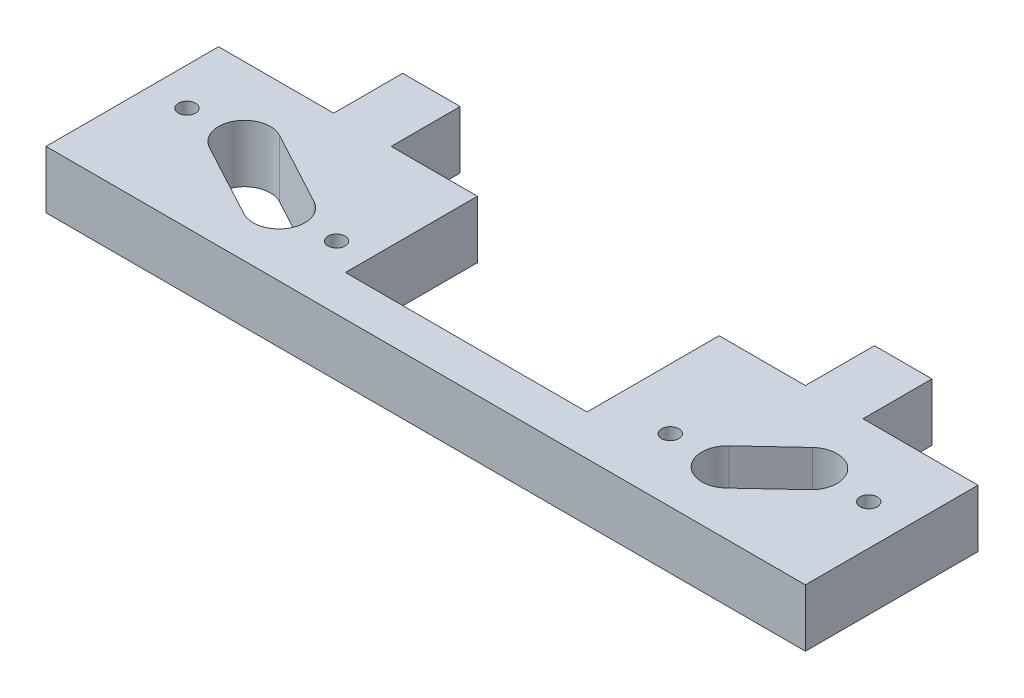
ISO-10303-21;
HEADER;
FILE_DESCRIPTION(('STEP AP214'),'2;1');
FILE_NAME('part.step','',(''),(''),'','','');
FILE_SCHEMA(('AUTOMOTIVE_DESIGN { 1 0 10303 214 1 1 1 1 }'));
ENDSEC;
DATA;
#1=APPLICATION_CONTEXT('core data for automotive mechanical design processes');
#2=APPLICATION_PROTOCOL_DEFINITION('international standard','automotive_design',2000,#1);
#3=PRODUCT_CONTEXT('',#1,'mechanical');
#4=PRODUCT('Part','Part','',(#3));
#5=PRODUCT_RELATED_PRODUCT_CATEGORY('part','',(#4));
#6=PRODUCT_DEFINITION_FORMATION('','',#4);
#7=PRODUCT_DEFINITION_CONTEXT('part definition',#1,'design');
#8=PRODUCT_DEFINITION('design','',#6,#7);
#9=PRODUCT_DEFINITION_SHAPE('','',#8);
#10=(LENGTH_UNIT() NAMED_UNIT(*) SI_UNIT(.MILLI.,.METRE.));
#11=(NAMED_UNIT(*) PLANE_ANGLE_UNIT() SI_UNIT($,.RADIAN.));
#12=(NAMED_UNIT(*) SI_UNIT($,.STERADIAN.) SOLID_ANGLE_UNIT());
#13=UNCERTAINTY_MEASURE_WITH_UNIT(LENGTH_MEASURE(1.E-05),#10,'distance_accuracy_value','');
#14=(GEOMETRIC_REPRESENTATION_CONTEXT(3) GLOBAL_UNCERTAINTY_ASSIGNED_CONTEXT((#13)) GLOBAL_UNIT_ASSIGNED_CONTEXT((#10,
#11,#12)) REPRESENTATION_CONTEXT('',''));
#15=CARTESIAN_POINT('',(0.,0.,0.));
#16=DIRECTION('',(0.,0.,1.));
#17=DIRECTION('',(1.,0.,0.));
#18=AXIS2_PLACEMENT_3D('',#15,#16,#17);
#19=CARTESIAN_POINT('',(0.,20.,0.));
#20=DIRECTION('',(0.,1.,0.));
#21=DIRECTION('',(0.,0.,1.));
#22=AXIS2_PLACEMENT_3D('',#19,#20,#21);
#23=PLANE('',#22);
#24=CARTESIAN_POINT('',(195.,20.,-22.));
#25=DIRECTION('',(0.,1.,0.));
#26=DIRECTION('',(0.,0.,1.));
#27=AXIS2_PLACEMENT_3D('',#24,#25,#26);
#28=CIRCLE('',#27,2.99999999999999);
#29=CARTESIAN_POINT('',(195.,20.,-19.));
#30=VERTEX_POINT('',#29);
#31=EDGE_CURVE('E300',#30,#30,#28,.T.);
#32=ORIENTED_EDGE('',*,*,#31,.F.);
#33=EDGE_LOOP('',(#32));
#34=FACE_BOUND('',#33,.T.);
#35=CARTESIAN_POINT('',(13.,20.,-36.));
#36=DIRECTION('',(0.,1.,0.));
#37=DIRECTION('',(0.,0.,1.));
#38=AXIS2_PLACEMENT_3D('',#35,#36,#37);
#39=CIRCLE('',#38,3.);
#40=CARTESIAN_POINT('',(13.,20.,-33.));
#41=VERTEX_POINT('',#40);
#42=EDGE_CURVE('E316',#41,#41,#39,.T.);
#43=ORIENTED_EDGE('',*,*,#42,.F.);
#44=EDGE_LOOP('',(#43));
#45=FACE_BOUND('',#44,.T.);
#46=DIRECTION('',(-1.,0.,0.));
#47=VECTOR('',#46,1.);
#48=CARTESIAN_POINT('',(60.,20.,-84.));
#49=LINE('',#48,#47);
#50=CARTESIAN_POINT('',(60.,20.,-84.));
#51=VERTEX_POINT('',#50);
#52=CARTESIAN_POINT('',(40.,20.,-84.));
#53=VERTEX_POINT('',#52);
#54=EDGE_CURVE('E324',#51,#53,#49,.T.);
#55=ORIENTED_EDGE('',*,*,#54,.T.);
#56=DIRECTION('',(0.,0.,1.));
#57=VECTOR('',#56,1.);
#58=CARTESIAN_POINT('',(40.,20.,-84.));
#59=LINE('',#58,#57);
#60=CARTESIAN_POINT('',(40.,20.,-60.));
#61=VERTEX_POINT('',#60);
#62=EDGE_CURVE('E328',#53,#61,#59,.T.);
#63=ORIENTED_EDGE('',*,*,#62,.T.);
#64=DIRECTION('',(-1.,0.,0.));
#65=VECTOR('',#64,1.);
#66=CARTESIAN_POINT('',(40.,20.,-60.));
#67=LINE('',#66,#65);
#68=CARTESIAN_POINT('',(0.,20.,-60.));
#69=VERTEX_POINT('',#68);
#70=EDGE_CURVE('E332',#61,#69,#67,.T.);
#71=ORIENTED_EDGE('',*,*,#70,.T.);
#72=DIRECTION('',(0.,0.,1.));
#73=VECTOR('',#72,1.);
#74=CARTESIAN_POINT('',(0.,20.,-60.));
#75=LINE('',#74,#73);
#76=CARTESIAN_POINT('',(0.,20.,0.));
#77=VERTEX_POINT('',#76);
#78=EDGE_CURVE('E335',#69,#77,#75,.T.);
#79=ORIENTED_EDGE('',*,*,#78,.T.);
#80=DIRECTION('',(1.,0.,0.));
#81=VECTOR('',#80,1.);
#82=CARTESIAN_POINT('',(0.,20.,0.));
#83=LINE('',#82,#81);
#84=CARTESIAN_POINT('',(264.,20.,0.));
#85=VERTEX_POINT('',#84);
#86=EDGE_CURVE('E338',#77,#85,#83,.T.);
#87=ORIENTED_EDGE('',*,*,#86,.T.);
#88=DIRECTION('',(0.,0.,-1.));
#89=VECTOR('',#88,1.);
#90=CARTESIAN_POINT('',(264.,20.,0.));
#91=LINE('',#90,#89);
#92=CARTESIAN_POINT('',(264.,20.,-60.));
#93=VERTEX_POINT('',#92);
#94=EDGE_CURVE('E341',#85,#93,#91,.T.);
#95=ORIENTED_EDGE('',*,*,#94,.T.);
#96=DIRECTION('',(-1.,0.,0.));
#97=VECTOR('',#96,1.);
#98=CARTESIAN_POINT('',(264.,20.,-60.));
#99=LINE('',#98,#97);
#100=CARTESIAN_POINT('',(224.,20.,-60.));
#101=VERTEX_POINT('',#100);
#102=EDGE_CURVE('E344',#93,#101,#99,.T.);
#103=ORIENTED_EDGE('',*,*,#102,.T.);
#104=DIRECTION('',(0.,0.,-1.));
#105=VECTOR('',#104,1.);
#106=CARTESIAN_POINT('',(224.,20.,-60.));
#107=LINE('',#106,#105);
#108=CARTESIAN_POINT('',(224.,20.,-84.));
#109=VERTEX_POINT('',#108);
#110=EDGE_CURVE('E347',#101,#109,#107,.T.);
#111=ORIENTED_EDGE('',*,*,#110,.T.);
#112=DIRECTION('',(-1.,0.,0.));
#113=VECTOR('',#112,1.);
#114=CARTESIAN_POINT('',(224.,20.,-84.));
#115=LINE('',#114,#113);
#116=CARTESIAN_POINT('',(204.,20.,-84.));
#117=VERTEX_POINT('',#116);
#118=EDGE_CURVE('E350',#109,#117,#115,.T.);
#119=ORIENTED_EDGE('',*,*,#118,.T.);
#120=DIRECTION('',(0.,0.,1.));
#121=VECTOR('',#120,1.);
#122=CARTESIAN_POINT('',(204.,20.,-60.));
#123=LINE('',#122,#121);
#124=CARTESIAN_POINT('',(204.,20.,-60.));
#125=VERTEX_POINT('',#124);
#126=EDGE_CURVE('E353',#117,#125,#123,.T.);
#127=ORIENTED_EDGE('',*,*,#126,.T.);
#128=DIRECTION('',(-1.,0.,0.));
#129=VECTOR('',#128,1.);
#130=CARTESIAN_POINT('',(174.,20.,-60.));
#131=LINE('',#130,#129);
#132=CARTESIAN_POINT('',(174.,20.,-60.));
#133=VERTEX_POINT('',#132);
#134=EDGE_CURVE('E356',#125,#133,#131,.T.);
#135=ORIENTED_EDGE('',*,*,#134,.T.);
#136=DIRECTION('',(0.,0.,1.));
#137=VECTOR('',#136,1.);
#138=CARTESIAN_POINT('',(174.,20.,-14.0757601007004));
#139=LINE('',#138,#137);
#140=CARTESIAN_POINT('',(174.,20.,-14.0757601007004));
#141=VERTEX_POINT('',#140);
#142=EDGE_CURVE('E359',#133,#141,#139,.T.);
#143=ORIENTED_EDGE('',*,*,#142,.T.);
#144=DIRECTION('',(-1.,0.,0.));
#145=VECTOR('',#144,1.);
#146=CARTESIAN_POINT('',(90.,20.,-14.0757601007004));
#147=LINE('',#146,#145);
#148=CARTESIAN_POINT('',(90.,20.,-14.0757601007004));
#149=VERTEX_POINT('',#148);
#150=EDGE_CURVE('E362',#141,#149,#147,.T.);
#151=ORIENTED_EDGE('',*,*,#150,.T.);
#152=DIRECTION('',(0.,0.,-1.));
#153=VECTOR('',#152,1.);
#154=CARTESIAN_POINT('',(90.,20.,-60.));
#155=LINE('',#154,#153);
#156=CARTESIAN_POINT('',(90.,20.,-60.));
#157=VERTEX_POINT('',#156);
#158=EDGE_CURVE('E365',#149,#157,#155,.T.);
#159=ORIENTED_EDGE('',*,*,#158,.T.);
#160=DIRECTION('',(-1.,0.,0.));
#161=VECTOR('',#160,1.);
#162=CARTESIAN_POINT('',(60.,20.,-60.));
#163=LINE('',#162,#161);
#164=CARTESIAN_POINT('',(60.,20.,-60.));
#165=VERTEX_POINT('',#164);
#166=EDGE_CURVE('E368',#157,#165,#163,.T.);
#167=ORIENTED_EDGE('',*,*,#166,.T.);
#168=DIRECTION('',(0.,0.,-1.));
#169=VECTOR('',#168,1.);
#170=CARTESIAN_POINT('',(60.,20.,-84.));
#171=LINE('',#170,#169);
#172=EDGE_CURVE('E371',#165,#51,#171,.T.);
#173=ORIENTED_EDGE('',*,*,#172,.T.);
#174=EDGE_LOOP('',(#55,#63,#71,#79,#87,#95,#103,#111,#119,#127,#135,#143,#151,#159,#167,#173));
#175=FACE_BOUND('',#174,.T.);
#176=CARTESIAN_POINT('',(79.,20.,-22.));
#177=DIRECTION('',(0.,1.,0.));
#178=DIRECTION('',(0.,0.,1.));
#179=AXIS2_PLACEMENT_3D('',#176,#177,#178);
#180=CIRCLE('',#179,3.00000000000001);
#181=CARTESIAN_POINT('',(79.,20.,-19.));
#182=VERTEX_POINT('',#181);
#183=EDGE_CURVE('E308',#182,#182,#180,.T.);
#184=ORIENTED_EDGE('',*,*,#183,.F.);
#185=EDGE_LOOP('',(#184));
#186=FACE_BOUND('',#185,.T.);
#187=CARTESIAN_POINT('',(250.,20.,-36.));
#188=DIRECTION('',(0.,1.,0.));
#189=DIRECTION('',(0.,0.,1.));
#190=AXIS2_PLACEMENT_3D('',#187,#188,#189);
#191=CIRCLE('',#190,2.99999999999999);
#192=CARTESIAN_POINT('',(250.,20.,-33.));
#193=VERTEX_POINT('',#192);
#194=EDGE_CURVE('E292',#193,#193,#191,.T.);
#195=ORIENTED_EDGE('',*,*,#194,.F.);
#196=EDGE_LOOP('',(#195));
#197=FACE_BOUND('',#196,.T.);
#198=DIRECTION('',(-0.880471099922175,0.,-0.474099823035018));
#199=VECTOR('',#198,1.);
#200=CARTESIAN_POINT('',(37.2668984073152,20.,-43.9242398992996));
#201=LINE('',#200,#199);
#202=CARTESIAN_POINT('',(63.2668984073151,20.,-29.9242398992996));
#203=VERTEX_POINT('',#202);
#204=CARTESIAN_POINT('',(37.2668984073152,20.,-43.9242398992996));
#205=VERTEX_POINT('',#204);
#206=EDGE_CURVE('E252',#203,#205,#201,.T.);
#207=ORIENTED_EDGE('',*,*,#206,.F.);
#208=CARTESIAN_POINT('',(59.,20.,-22.));
#209=DIRECTION('',(0.,1.,0.));
#210=DIRECTION('',(0.,0.,1.));
#211=AXIS2_PLACEMENT_3D('',#208,#209,#210);
#212=CIRCLE('',#211,9.);
#213=CARTESIAN_POINT('',(54.7331015926848,20.,-14.0757601007004));
#214=VERTEX_POINT('',#213);
#215=EDGE_CURVE('E249',#214,#203,#212,.T.);
#216=ORIENTED_EDGE('',*,*,#215,.F.);
#217=DIRECTION('',(0.880471099922175,0.,0.474099823035017));
#218=VECTOR('',#217,1.);
#219=CARTESIAN_POINT('',(28.7331015926848,20.,-28.0757601007004));
#220=LINE('',#219,#218);
#221=CARTESIAN_POINT('',(28.7331015926848,20.,-28.0757601007004));
#222=VERTEX_POINT('',#221);
#223=EDGE_CURVE('E260',#222,#214,#220,.T.);
#224=ORIENTED_EDGE('',*,*,#223,.F.);
#225=CARTESIAN_POINT('',(33.,20.,-36.));
#226=DIRECTION('',(0.,1.,0.));
#227=DIRECTION('',(0.,0.,1.));
#228=AXIS2_PLACEMENT_3D('',#225,#226,#227);
#229=CIRCLE('',#228,9.00000000000001);
#230=EDGE_CURVE('E256',#205,#222,#229,.T.);
#231=ORIENTED_EDGE('',*,*,#230,.F.);
#232=EDGE_LOOP('',(#207,#216,#224,#231));
#233=FACE_BOUND('',#232,.T.);
#234=DIRECTION('',(-0.73105526824287,0.,0.68231825036001));
#235=VECTOR('',#234,1.);
#236=CARTESIAN_POINT('',(208.85913574676,20.,-28.5794974141858));
#237=LINE('',#236,#235);
#238=CARTESIAN_POINT('',(223.85913574676,20.,-42.5794974141858));
#239=VERTEX_POINT('',#238);
#240=CARTESIAN_POINT('',(208.85913574676,20.,-28.5794974141859));
#241=VERTEX_POINT('',#240);
#242=EDGE_CURVE('E210',#239,#241,#237,.T.);
#243=ORIENTED_EDGE('',*,*,#242,.F.);
#244=CARTESIAN_POINT('',(230.,20.,-36.));
#245=DIRECTION('',(0.,1.,0.));
#246=DIRECTION('',(0.,0.,1.));
#247=AXIS2_PLACEMENT_3D('',#244,#245,#246);
#248=CIRCLE('',#247,9.00000000000001);
#249=CARTESIAN_POINT('',(236.14086425324,20.,-29.4205025858142));
#250=VERTEX_POINT('',#249);
#251=EDGE_CURVE('E201',#250,#239,#248,.T.);
#252=ORIENTED_EDGE('',*,*,#251,.F.);
#253=DIRECTION('',(0.731055268242868,0.,-0.682318250360013));
#254=VECTOR('',#253,1.);
#255=CARTESIAN_POINT('',(236.14086425324,20.,-29.4205025858142));
#256=LINE('',#255,#254);
#257=CARTESIAN_POINT('',(221.14086425324,20.,-15.4205025858142));
#258=VERTEX_POINT('',#257);
#259=EDGE_CURVE('E227',#258,#250,#256,.T.);
#260=ORIENTED_EDGE('',*,*,#259,.F.);
#261=CARTESIAN_POINT('',(215.,20.,-22.));
#262=DIRECTION('',(0.,1.,0.));
#263=DIRECTION('',(0.,0.,1.));
#264=AXIS2_PLACEMENT_3D('',#261,#262,#263);
#265=CIRCLE('',#264,9.00000000000005);
#266=EDGE_CURVE('E223',#241,#258,#265,.T.);
#267=ORIENTED_EDGE('',*,*,#266,.F.);
#268=EDGE_LOOP('',(#243,#252,#260,#267));
#269=FACE_BOUND('',#268,.T.);
#270=ADVANCED_FACE('F39',(#34,#45,#175,#186,#197,#233,#269),#23,.T.);
#271=CARTESIAN_POINT('',(0.,0.,0.));
#272=DIRECTION('',(0.,1.,0.));
#273=DIRECTION('',(0.,0.,1.));
#274=AXIS2_PLACEMENT_3D('',#271,#272,#273);
#275=PLANE('',#274);
#276=CARTESIAN_POINT('',(59.,0.,-22.));
#277=DIRECTION('',(0.,1.,0.));
#278=DIRECTION('',(0.,0.,1.));
#279=AXIS2_PLACEMENT_3D('',#276,#277,#278);
#280=CIRCLE('',#279,9.);
#281=CARTESIAN_POINT('',(54.7331015926848,0.,-14.0757601007004));
#282=VERTEX_POINT('',#281);
#283=CARTESIAN_POINT('',(63.2668984073151,0.,-29.9242398992996));
#284=VERTEX_POINT('',#283);
#285=EDGE_CURVE('E219',#282,#284,#280,.T.);
#286=ORIENTED_EDGE('',*,*,#285,.T.);
#287=DIRECTION('',(-0.880471099922175,0.,-0.474099823035018));
#288=VECTOR('',#287,1.);
#289=CARTESIAN_POINT('',(37.2668984073152,0.,-43.9242398992996));
#290=LINE('',#289,#288);
#291=CARTESIAN_POINT('',(37.2668984073152,0.,-43.9242398992996));
#292=VERTEX_POINT('',#291);
#293=EDGE_CURVE('E267',#284,#292,#290,.T.);
#294=ORIENTED_EDGE('',*,*,#293,.T.);
#295=CARTESIAN_POINT('',(33.,0.,-36.));
#296=DIRECTION('',(0.,1.,0.));
#297=DIRECTION('',(0.,0.,1.));
#298=AXIS2_PLACEMENT_3D('',#295,#296,#297);
#299=CIRCLE('',#298,9.00000000000001);
#300=CARTESIAN_POINT('',(28.7331015926848,0.,-28.0757601007004));
#301=VERTEX_POINT('',#300);
#302=EDGE_CURVE('E271',#292,#301,#299,.T.);
#303=ORIENTED_EDGE('',*,*,#302,.T.);
#304=DIRECTION('',(0.880471099922175,0.,0.474099823035017));
#305=VECTOR('',#304,1.);
#306=CARTESIAN_POINT('',(28.7331015926848,0.,-28.0757601007004));
#307=LINE('',#306,#305);
#308=EDGE_CURVE('E253',#301,#282,#307,.T.);
#309=ORIENTED_EDGE('',*,*,#308,.T.);
#310=EDGE_LOOP('',(#286,#294,#303,#309));
#311=FACE_BOUND('',#310,.T.);
#312=DIRECTION('',(-1.,0.,0.));
#313=VECTOR('',#312,1.);
#314=CARTESIAN_POINT('',(60.,0.,-84.));
#315=LINE('',#314,#313);
#316=CARTESIAN_POINT('',(60.,0.,-84.));
#317=VERTEX_POINT('',#316);
#318=CARTESIAN_POINT('',(40.,0.,-84.));
#319=VERTEX_POINT('',#318);
#320=EDGE_CURVE('E320',#317,#319,#315,.T.);
#321=ORIENTED_EDGE('',*,*,#320,.F.);
#322=DIRECTION('',(0.,0.,-1.));
#323=VECTOR('',#322,1.);
#324=CARTESIAN_POINT('',(60.,0.,-84.));
#325=LINE('',#324,#323);
#326=CARTESIAN_POINT('',(60.,0.,-60.));
#327=VERTEX_POINT('',#326);
#328=EDGE_CURVE('E329',#327,#317,#325,.T.);
#329=ORIENTED_EDGE('',*,*,#328,.F.);
#330=DIRECTION('',(-1.,0.,0.));
#331=VECTOR('',#330,1.);
#332=CARTESIAN_POINT('',(60.,0.,-60.));
#333=LINE('',#332,#331);
#334=CARTESIAN_POINT('',(90.,0.,-60.));
#335=VERTEX_POINT('',#334);
#336=EDGE_CURVE('E417',#335,#327,#333,.T.);
#337=ORIENTED_EDGE('',*,*,#336,.F.);
#338=DIRECTION('',(0.,0.,-1.));
#339=VECTOR('',#338,1.);
#340=CARTESIAN_POINT('',(90.,0.,-60.));
#341=LINE('',#340,#339);
#342=CARTESIAN_POINT('',(90.,0.,-14.0757601007004));
#343=VERTEX_POINT('',#342);
#344=EDGE_CURVE('E414',#343,#335,#341,.T.);
#345=ORIENTED_EDGE('',*,*,#344,.F.);
#346=DIRECTION('',(-1.,0.,0.));
#347=VECTOR('',#346,1.);
#348=CARTESIAN_POINT('',(90.,0.,-14.0757601007004));
#349=LINE('',#348,#347);
#350=CARTESIAN_POINT('',(174.,0.,-14.0757601007004));
#351=VERTEX_POINT('',#350);
#352=EDGE_CURVE('E411',#351,#343,#349,.T.);
#353=ORIENTED_EDGE('',*,*,#352,.F.);
#354=DIRECTION('',(0.,0.,1.));
#355=VECTOR('',#354,1.);
#356=CARTESIAN_POINT('',(174.,0.,-14.0757601007004));
#357=LINE('',#356,#355);
#358=CARTESIAN_POINT('',(174.,0.,-60.));
#359=VERTEX_POINT('',#358);
#360=EDGE_CURVE('E408',#359,#351,#357,.T.);
#361=ORIENTED_EDGE('',*,*,#360,.F.);
#362=DIRECTION('',(-1.,0.,0.));
#363=VECTOR('',#362,1.);
#364=CARTESIAN_POINT('',(174.,0.,-60.));
#365=LINE('',#364,#363);
#366=CARTESIAN_POINT('',(204.,0.,-60.));
#367=VERTEX_POINT('',#366);
#368=EDGE_CURVE('E405',#367,#359,#365,.T.);
#369=ORIENTED_EDGE('',*,*,#368,.F.);
#370=DIRECTION('',(0.,0.,1.));
#371=VECTOR('',#370,1.);
#372=CARTESIAN_POINT('',(204.,0.,-60.));
#373=LINE('',#372,#371);
#374=CARTESIAN_POINT('',(204.,0.,-84.));
#375=VERTEX_POINT('',#374);
#376=EDGE_CURVE('E402',#375,#367,#373,.T.);
#377=ORIENTED_EDGE('',*,*,#376,.F.);
#378=DIRECTION('',(-1.,0.,0.));
#379=VECTOR('',#378,1.);
#380=CARTESIAN_POINT('',(224.,0.,-84.));
#381=LINE('',#380,#379);
#382=CARTESIAN_POINT('',(224.,0.,-84.));
#383=VERTEX_POINT('',#382);
#384=EDGE_CURVE('E399',#383,#375,#381,.T.);
#385=ORIENTED_EDGE('',*,*,#384,.F.);
#386=DIRECTION('',(0.,0.,-1.));
#387=VECTOR('',#386,1.);
#388=CARTESIAN_POINT('',(224.,0.,-60.));
#389=LINE('',#388,#387);
#390=CARTESIAN_POINT('',(224.,0.,-60.));
#391=VERTEX_POINT('',#390);
#392=EDGE_CURVE('E396',#391,#383,#389,.T.);
#393=ORIENTED_EDGE('',*,*,#392,.F.);
#394=DIRECTION('',(-1.,0.,0.));
#395=VECTOR('',#394,1.);
#396=CARTESIAN_POINT('',(264.,0.,-60.));
#397=LINE('',#396,#395);
#398=CARTESIAN_POINT('',(264.,0.,-60.));
#399=VERTEX_POINT('',#398);
#400=EDGE_CURVE('E393',#399,#391,#397,.T.);
#401=ORIENTED_EDGE('',*,*,#400,.F.);
#402=DIRECTION('',(0.,0.,-1.));
#403=VECTOR('',#402,1.);
#404=CARTESIAN_POINT('',(264.,0.,0.));
#405=LINE('',#404,#403);
#406=CARTESIAN_POINT('',(264.,0.,0.));
#407=VERTEX_POINT('',#406);
#408=EDGE_CURVE('E390',#407,#399,#405,.T.);
#409=ORIENTED_EDGE('',*,*,#408,.F.);
#410=DIRECTION('',(1.,0.,0.));
#411=VECTOR('',#410,1.);
#412=CARTESIAN_POINT('',(0.,0.,0.));
#413=LINE('',#412,#411);
#414=CARTESIAN_POINT('',(0.,0.,0.));
#415=VERTEX_POINT('',#414);
#416=EDGE_CURVE('E387',#415,#407,#413,.T.);
#417=ORIENTED_EDGE('',*,*,#416,.F.);
#418=DIRECTION('',(0.,0.,1.));
#419=VECTOR('',#418,1.);
#420=CARTESIAN_POINT('',(0.,0.,-60.));
#421=LINE('',#420,#419);
#422=CARTESIAN_POINT('',(0.,0.,-60.));
#423=VERTEX_POINT('',#422);
#424=EDGE_CURVE('E384',#423,#415,#421,.T.);
#425=ORIENTED_EDGE('',*,*,#424,.F.);
#426=DIRECTION('',(-1.,0.,0.));
#427=VECTOR('',#426,1.);
#428=CARTESIAN_POINT('',(40.,0.,-60.));
#429=LINE('',#428,#427);
#430=CARTESIAN_POINT('',(40.,0.,-60.));
#431=VERTEX_POINT('',#430);
#432=EDGE_CURVE('E381',#431,#423,#429,.T.);
#433=ORIENTED_EDGE('',*,*,#432,.F.);
#434=DIRECTION('',(0.,0.,1.));
#435=VECTOR('',#434,1.);
#436=CARTESIAN_POINT('',(40.,0.,-84.));
#437=LINE('',#436,#435);
#438=EDGE_CURVE('E378',#319,#431,#437,.T.);
#439=ORIENTED_EDGE('',*,*,#438,.F.);
#440=EDGE_LOOP('',(#321,#329,#337,#345,#353,#361,#369,#377,#385,#393,#401,#409,#417,#425,#433,#439));
#441=FACE_BOUND('',#440,.T.);
#442=CARTESIAN_POINT('',(13.,0.,-36.));
#443=DIRECTION('',(0.,1.,0.));
#444=DIRECTION('',(0.,0.,1.));
#445=AXIS2_PLACEMENT_3D('',#442,#443,#444);
#446=CIRCLE('',#445,3.);
#447=CARTESIAN_POINT('',(13.,0.,-33.));
#448=VERTEX_POINT('',#447);
#449=EDGE_CURVE('E312',#448,#448,#446,.T.);
#450=ORIENTED_EDGE('',*,*,#449,.T.);
#451=EDGE_LOOP('',(#450));
#452=FACE_BOUND('',#451,.T.);
#453=CARTESIAN_POINT('',(79.,0.,-22.));
#454=DIRECTION('',(0.,1.,0.));
#455=DIRECTION('',(0.,0.,1.));
#456=AXIS2_PLACEMENT_3D('',#453,#454,#455);
#457=CIRCLE('',#456,3.00000000000001);
#458=CARTESIAN_POINT('',(79.,0.,-19.));
#459=VERTEX_POINT('',#458);
#460=EDGE_CURVE('E304',#459,#459,#457,.T.);
#461=ORIENTED_EDGE('',*,*,#460,.T.);
#462=EDGE_LOOP('',(#461));
#463=FACE_BOUND('',#462,.T.);
#464=CARTESIAN_POINT('',(195.,0.,-22.));
#465=DIRECTION('',(0.,1.,0.));
#466=DIRECTION('',(0.,0.,1.));
#467=AXIS2_PLACEMENT_3D('',#464,#465,#466);
#468=CIRCLE('',#467,2.99999999999999);
#469=CARTESIAN_POINT('',(195.,0.,-19.));
#470=VERTEX_POINT('',#469);
#471=EDGE_CURVE('E296',#470,#470,#468,.T.);
#472=ORIENTED_EDGE('',*,*,#471,.T.);
#473=EDGE_LOOP('',(#472));
#474=FACE_BOUND('',#473,.T.);
#475=CARTESIAN_POINT('',(250.,0.,-36.));
#476=DIRECTION('',(0.,1.,0.));
#477=DIRECTION('',(0.,0.,1.));
#478=AXIS2_PLACEMENT_3D('',#475,#476,#477);
#479=CIRCLE('',#478,2.99999999999999);
#480=CARTESIAN_POINT('',(250.,0.,-33.));
#481=VERTEX_POINT('',#480);
#482=EDGE_CURVE('E291',#481,#481,#479,.T.);
#483=ORIENTED_EDGE('',*,*,#482,.T.);
#484=EDGE_LOOP('',(#483));
#485=FACE_BOUND('',#484,.T.);
#486=CARTESIAN_POINT('',(230.,0.,-36.));
#487=DIRECTION('',(0.,1.,0.));
#488=DIRECTION('',(0.,0.,1.));
#489=AXIS2_PLACEMENT_3D('',#486,#487,#488);
#490=CIRCLE('',#489,9.00000000000001);
#491=CARTESIAN_POINT('',(236.14086425324,0.,-29.4205025858142));
#492=VERTEX_POINT('',#491);
#493=CARTESIAN_POINT('',(223.85913574676,0.,-42.5794974141858));
#494=VERTEX_POINT('',#493);
#495=EDGE_CURVE('E63',#492,#494,#490,.T.);
#496=ORIENTED_EDGE('',*,*,#495,.T.);
#497=DIRECTION('',(-0.73105526824287,0.,0.68231825036001));
#498=VECTOR('',#497,1.);
#499=CARTESIAN_POINT('',(208.85913574676,0.,-28.5794974141858));
#500=LINE('',#499,#498);
#501=CARTESIAN_POINT('',(208.85913574676,0.,-28.5794974141859));
#502=VERTEX_POINT('',#501);
#503=EDGE_CURVE('E217',#494,#502,#500,.T.);
#504=ORIENTED_EDGE('',*,*,#503,.T.);
#505=CARTESIAN_POINT('',(215.,0.,-22.));
#506=DIRECTION('',(0.,1.,0.));
#507=DIRECTION('',(0.,0.,1.));
#508=AXIS2_PLACEMENT_3D('',#505,#506,#507);
#509=CIRCLE('',#508,9.00000000000005);
#510=CARTESIAN_POINT('',(221.14086425324,0.,-15.4205025858142));
#511=VERTEX_POINT('',#510);
#512=EDGE_CURVE('E236',#502,#511,#509,.T.);
#513=ORIENTED_EDGE('',*,*,#512,.T.);
#514=DIRECTION('',(0.731055268242868,0.,-0.682318250360013));
#515=VECTOR('',#514,1.);
#516=CARTESIAN_POINT('',(236.14086425324,0.,-29.4205025858142));
#517=LINE('',#516,#515);
#518=EDGE_CURVE('E211',#511,#492,#517,.T.);
#519=ORIENTED_EDGE('',*,*,#518,.T.);
#520=EDGE_LOOP('',(#496,#504,#513,#519));
#521=FACE_BOUND('',#520,.T.);
#522=ADVANCED_FACE('F488',(#311,#441,#452,#463,#474,#485,#521),#275,.F.);
#523=CARTESIAN_POINT('',(60.,20.,-84.));
#524=DIRECTION('',(0.,0.,1.));
#525=DIRECTION('',(1.,0.,0.));
#526=AXIS2_PLACEMENT_3D('',#523,#524,#525);
#527=PLANE('',#526);
#528=ORIENTED_EDGE('',*,*,#320,.T.);
#529=DIRECTION('',(0.,-1.,0.));
#530=VECTOR('',#529,1.);
#531=CARTESIAN_POINT('',(40.,20.,-84.));
#532=LINE('',#531,#530);
#533=EDGE_CURVE('E11',#53,#319,#532,.T.);
#534=ORIENTED_EDGE('',*,*,#533,.F.);
#535=ORIENTED_EDGE('',*,*,#54,.F.);
#536=DIRECTION('',(0.,-1.,0.));
#537=VECTOR('',#536,1.);
#538=CARTESIAN_POINT('',(60.,20.,-84.));
#539=LINE('',#538,#537);
#540=EDGE_CURVE('E374',#51,#317,#539,.T.);
#541=ORIENTED_EDGE('',*,*,#540,.T.);
#542=EDGE_LOOP('',(#528,#534,#535,#541));
#543=FACE_BOUND('',#542,.T.);
#544=ADVANCED_FACE('F41',(#543),#527,.F.);
#545=CARTESIAN_POINT('',(40.,20.,-84.));
#546=DIRECTION('',(1.,0.,0.));
#547=DIRECTION('',(0.,0.,-1.));
#548=AXIS2_PLACEMENT_3D('',#545,#546,#547);
#549=PLANE('',#548);
#550=ORIENTED_EDGE('',*,*,#438,.T.);
#551=DIRECTION('',(0.,-1.,0.));
#552=VECTOR('',#551,1.);
#553=CARTESIAN_POINT('',(40.,20.,-60.));
#554=LINE('',#553,#552);
#555=EDGE_CURVE('E48',#61,#431,#554,.T.);
#556=ORIENTED_EDGE('',*,*,#555,.F.);
#557=ORIENTED_EDGE('',*,*,#62,.F.);
#558=ORIENTED_EDGE('',*,*,#533,.T.);
#559=EDGE_LOOP('',(#550,#556,#557,#558));
#560=FACE_BOUND('',#559,.T.);
#561=ADVANCED_FACE('F506',(#560),#549,.F.);
#562=CARTESIAN_POINT('',(40.,20.,-60.));
#563=DIRECTION('',(0.,0.,1.));
#564=DIRECTION('',(1.,0.,0.));
#565=AXIS2_PLACEMENT_3D('',#562,#563,#564);
#566=PLANE('',#565);
#567=ORIENTED_EDGE('',*,*,#432,.T.);
#568=DIRECTION('',(0.,-1.,0.));
#569=VECTOR('',#568,1.);
#570=CARTESIAN_POINT('',(0.,20.,-60.));
#571=LINE('',#570,#569);
#572=EDGE_CURVE('E473',#69,#423,#571,.T.);
#573=ORIENTED_EDGE('',*,*,#572,.F.);
#574=ORIENTED_EDGE('',*,*,#70,.F.);
#575=ORIENTED_EDGE('',*,*,#555,.T.);
#576=EDGE_LOOP('',(#567,#573,#574,#575));
#577=FACE_BOUND('',#576,.T.);
#578=ADVANCED_FACE('F482',(#577),#566,.F.);
#579=CARTESIAN_POINT('',(0.,20.,-60.));
#580=DIRECTION('',(1.,0.,0.));
#581=DIRECTION('',(0.,0.,-1.));
#582=AXIS2_PLACEMENT_3D('',#579,#580,#581);
#583=PLANE('',#582);
#584=ORIENTED_EDGE('',*,*,#424,.T.);
#585=DIRECTION('',(0.,-1.,0.));
#586=VECTOR('',#585,1.);
#587=CARTESIAN_POINT('',(0.,20.,0.));
#588=LINE('',#587,#586);
#589=EDGE_CURVE('E469',#77,#415,#588,.T.);
#590=ORIENTED_EDGE('',*,*,#589,.F.);
#591=ORIENTED_EDGE('',*,*,#78,.F.);
#592=ORIENTED_EDGE('',*,*,#572,.T.);
#593=EDGE_LOOP('',(#584,#590,#591,#592));
#594=FACE_BOUND('',#593,.T.);
#595=ADVANCED_FACE('F494',(#594),#583,.F.);
#596=CARTESIAN_POINT('',(0.,20.,0.));
#597=DIRECTION('',(0.,0.,-1.));
#598=DIRECTION('',(-1.,0.,0.));
#599=AXIS2_PLACEMENT_3D('',#596,#597,#598);
#600=PLANE('',#599);
#601=ORIENTED_EDGE('',*,*,#416,.T.);
#602=DIRECTION('',(0.,-1.,0.));
#603=VECTOR('',#602,1.);
#604=CARTESIAN_POINT('',(264.,20.,0.));
#605=LINE('',#604,#603);
#606=EDGE_CURVE('E465',#85,#407,#605,.T.);
#607=ORIENTED_EDGE('',*,*,#606,.F.);
#608=ORIENTED_EDGE('',*,*,#86,.F.);
#609=ORIENTED_EDGE('',*,*,#589,.T.);
#610=EDGE_LOOP('',(#601,#607,#608,#609));
#611=FACE_BOUND('',#610,.T.);
#612=ADVANCED_FACE('F498',(#611),#600,.F.);
#613=CARTESIAN_POINT('',(264.,20.,0.));
#614=DIRECTION('',(-1.,0.,0.));
#615=DIRECTION('',(0.,0.,1.));
#616=AXIS2_PLACEMENT_3D('',#613,#614,#615);
#617=PLANE('',#616);
#618=ORIENTED_EDGE('',*,*,#408,.T.);
#619=DIRECTION('',(0.,-1.,0.));
#620=VECTOR('',#619,1.);
#621=CARTESIAN_POINT('',(264.,20.,-60.));
#622=LINE('',#621,#620);
#623=EDGE_CURVE('E461',#93,#399,#622,.T.);
#624=ORIENTED_EDGE('',*,*,#623,.F.);
#625=ORIENTED_EDGE('',*,*,#94,.F.);
#626=ORIENTED_EDGE('',*,*,#606,.T.);
#627=EDGE_LOOP('',(#618,#624,#625,#626));
#628=FACE_BOUND('',#627,.T.);
#629=ADVANCED_FACE('F559',(#628),#617,.F.);
#630=CARTESIAN_POINT('',(264.,20.,-60.));
#631=DIRECTION('',(0.,0.,1.));
#632=DIRECTION('',(1.,0.,0.));
#633=AXIS2_PLACEMENT_3D('',#630,#631,#632);
#634=PLANE('',#633);
#635=ORIENTED_EDGE('',*,*,#400,.T.);
#636=DIRECTION('',(0.,-1.,0.));
#637=VECTOR('',#636,1.);
#638=CARTESIAN_POINT('',(224.,20.,-60.));
#639=LINE('',#638,#637);
#640=EDGE_CURVE('E457',#101,#391,#639,.T.);
#641=ORIENTED_EDGE('',*,*,#640,.F.);
#642=ORIENTED_EDGE('',*,*,#102,.F.);
#643=ORIENTED_EDGE('',*,*,#623,.T.);
#644=EDGE_LOOP('',(#635,#641,#642,#643));
#645=FACE_BOUND('',#644,.T.);
#646=ADVANCED_FACE('F556',(#645),#634,.F.);
#647=CARTESIAN_POINT('',(224.,20.,-60.));
#648=DIRECTION('',(-1.,0.,0.));
#649=DIRECTION('',(0.,0.,1.));
#650=AXIS2_PLACEMENT_3D('',#647,#648,#649);
#651=PLANE('',#650);
#652=ORIENTED_EDGE('',*,*,#392,.T.);
#653=DIRECTION('',(0.,-1.,0.));
#654=VECTOR('',#653,1.);
#655=CARTESIAN_POINT('',(224.,20.,-84.));
#656=LINE('',#655,#654);
#657=EDGE_CURVE('E453',#109,#383,#656,.T.);
#658=ORIENTED_EDGE('',*,*,#657,.F.);
#659=ORIENTED_EDGE('',*,*,#110,.F.);
#660=ORIENTED_EDGE('',*,*,#640,.T.);
#661=EDGE_LOOP('',(#652,#658,#659,#660));
#662=FACE_BOUND('',#661,.T.);
#663=ADVANCED_FACE('F552',(#662),#651,.F.);
#664=CARTESIAN_POINT('',(224.,20.,-84.));
#665=DIRECTION('',(0.,0.,1.));
#666=DIRECTION('',(1.,0.,0.));
#667=AXIS2_PLACEMENT_3D('',#664,#665,#666);
#668=PLANE('',#667);
#669=ORIENTED_EDGE('',*,*,#384,.T.);
#670=DIRECTION('',(0.,-1.,0.));
#671=VECTOR('',#670,1.);
#672=CARTESIAN_POINT('',(204.,20.,-84.));
#673=LINE('',#672,#671);
#674=EDGE_CURVE('E449',#117,#375,#673,.T.);
#675=ORIENTED_EDGE('',*,*,#674,.F.);
#676=ORIENTED_EDGE('',*,*,#118,.F.);
#677=ORIENTED_EDGE('',*,*,#657,.T.);
#678=EDGE_LOOP('',(#669,#675,#676,#677));
#679=FACE_BOUND('',#678,.T.);
#680=ADVANCED_FACE('F548',(#679),#668,.F.);
#681=CARTESIAN_POINT('',(204.,20.,-60.));
#682=DIRECTION('',(1.,0.,0.));
#683=DIRECTION('',(0.,0.,-1.));
#684=AXIS2_PLACEMENT_3D('',#681,#682,#683);
#685=PLANE('',#684);
#686=ORIENTED_EDGE('',*,*,#376,.T.);
#687=DIRECTION('',(0.,-1.,0.));
#688=VECTOR('',#687,1.);
#689=CARTESIAN_POINT('',(204.,20.,-60.));
#690=LINE('',#689,#688);
#691=EDGE_CURVE('E445',#125,#367,#690,.T.);
#692=ORIENTED_EDGE('',*,*,#691,.F.);
#693=ORIENTED_EDGE('',*,*,#126,.F.);
#694=ORIENTED_EDGE('',*,*,#674,.T.);
#695=EDGE_LOOP('',(#686,#692,#693,#694));
#696=FACE_BOUND('',#695,.T.);
#697=ADVANCED_FACE('F543',(#696),#685,.F.);
#698=CARTESIAN_POINT('',(174.,20.,-60.));
#699=DIRECTION('',(0.,0.,1.));
#700=DIRECTION('',(1.,0.,0.));
#701=AXIS2_PLACEMENT_3D('',#698,#699,#700);
#702=PLANE('',#701);
#703=ORIENTED_EDGE('',*,*,#368,.T.);
#704=DIRECTION('',(0.,-1.,0.));
#705=VECTOR('',#704,1.);
#706=CARTESIAN_POINT('',(174.,20.,-60.));
#707=LINE('',#706,#705);
#708=EDGE_CURVE('E441',#133,#359,#707,.T.);
#709=ORIENTED_EDGE('',*,*,#708,.F.);
#710=ORIENTED_EDGE('',*,*,#134,.F.);
#711=ORIENTED_EDGE('',*,*,#691,.T.);
#712=EDGE_LOOP('',(#703,#709,#710,#711));
#713=FACE_BOUND('',#712,.T.);
#714=ADVANCED_FACE('F537',(#713),#702,.F.);
#715=CARTESIAN_POINT('',(174.,20.,-14.0757601007004));
#716=DIRECTION('',(1.,0.,0.));
#717=DIRECTION('',(0.,0.,-1.));
#718=AXIS2_PLACEMENT_3D('',#715,#716,#717);
#719=PLANE('',#718);
#720=ORIENTED_EDGE('',*,*,#360,.T.);
#721=DIRECTION('',(0.,-1.,0.));
#722=VECTOR('',#721,1.);
#723=CARTESIAN_POINT('',(174.,20.,-14.0757601007004));
#724=LINE('',#723,#722);
#725=EDGE_CURVE('E437',#141,#351,#724,.T.);
#726=ORIENTED_EDGE('',*,*,#725,.F.);
#727=ORIENTED_EDGE('',*,*,#142,.F.);
#728=ORIENTED_EDGE('',*,*,#708,.T.);
#729=EDGE_LOOP('',(#720,#726,#727,#728));
#730=FACE_BOUND('',#729,.T.);
#731=ADVANCED_FACE('F533',(#730),#719,.F.);
#732=CARTESIAN_POINT('',(90.,20.,-14.0757601007004));
#733=DIRECTION('',(0.,0.,1.));
#734=DIRECTION('',(1.,0.,0.));
#735=AXIS2_PLACEMENT_3D('',#732,#733,#734);
#736=PLANE('',#735);
#737=ORIENTED_EDGE('',*,*,#352,.T.);
#738=DIRECTION('',(0.,-1.,0.));
#739=VECTOR('',#738,1.);
#740=CARTESIAN_POINT('',(90.,20.,-14.0757601007004));
#741=LINE('',#740,#739);
#742=EDGE_CURVE('E433',#149,#343,#741,.T.);
#743=ORIENTED_EDGE('',*,*,#742,.F.);
#744=ORIENTED_EDGE('',*,*,#150,.F.);
#745=ORIENTED_EDGE('',*,*,#725,.T.);
#746=EDGE_LOOP('',(#737,#743,#744,#745));
#747=FACE_BOUND('',#746,.T.);
#748=ADVANCED_FACE('F528',(#747),#736,.F.);
#749=CARTESIAN_POINT('',(90.,20.,-60.));
#750=DIRECTION('',(-1.,0.,0.));
#751=DIRECTION('',(0.,0.,1.));
#752=AXIS2_PLACEMENT_3D('',#749,#750,#751);
#753=PLANE('',#752);
#754=ORIENTED_EDGE('',*,*,#344,.T.);
#755=DIRECTION('',(0.,-1.,0.));
#756=VECTOR('',#755,1.);
#757=CARTESIAN_POINT('',(90.,20.,-60.));
#758=LINE('',#757,#756);
#759=EDGE_CURVE('E429',#157,#335,#758,.T.);
#760=ORIENTED_EDGE('',*,*,#759,.F.);
#761=ORIENTED_EDGE('',*,*,#158,.F.);
#762=ORIENTED_EDGE('',*,*,#742,.T.);
#763=EDGE_LOOP('',(#754,#760,#761,#762));
#764=FACE_BOUND('',#763,.T.);
#765=ADVANCED_FACE('F522',(#764),#753,.F.);
#766=CARTESIAN_POINT('',(60.,20.,-60.));
#767=DIRECTION('',(0.,0.,1.));
#768=DIRECTION('',(1.,0.,0.));
#769=AXIS2_PLACEMENT_3D('',#766,#767,#768);
#770=PLANE('',#769);
#771=ORIENTED_EDGE('',*,*,#336,.T.);
#772=DIRECTION('',(0.,-1.,0.));
#773=VECTOR('',#772,1.);
#774=CARTESIAN_POINT('',(60.,20.,-60.));
#775=LINE('',#774,#773);
#776=EDGE_CURVE('E425',#165,#327,#775,.T.);
#777=ORIENTED_EDGE('',*,*,#776,.F.);
#778=ORIENTED_EDGE('',*,*,#166,.F.);
#779=ORIENTED_EDGE('',*,*,#759,.T.);
#780=EDGE_LOOP('',(#771,#777,#778,#779));
#781=FACE_BOUND('',#780,.T.);
#782=ADVANCED_FACE('F518',(#781),#770,.F.);
#783=CARTESIAN_POINT('',(60.,20.,-84.));
#784=DIRECTION('',(-1.,0.,0.));
#785=DIRECTION('',(0.,0.,1.));
#786=AXIS2_PLACEMENT_3D('',#783,#784,#785);
#787=PLANE('',#786);
#788=ORIENTED_EDGE('',*,*,#328,.T.);
#789=ORIENTED_EDGE('',*,*,#540,.F.);
#790=ORIENTED_EDGE('',*,*,#172,.F.);
#791=ORIENTED_EDGE('',*,*,#776,.T.);
#792=EDGE_LOOP('',(#788,#789,#790,#791));
#793=FACE_BOUND('',#792,.T.);
#794=ADVANCED_FACE('F513',(#793),#787,.F.);
#795=CARTESIAN_POINT('',(13.,20.,-36.));
#796=DIRECTION('',(0.,-1.,0.));
#797=DIRECTION('',(0.,0.,-1.));
#798=AXIS2_PLACEMENT_3D('',#795,#796,#797);
#799=CYLINDRICAL_SURFACE('',#798,3.);
#800=ORIENTED_EDGE('',*,*,#42,.T.);
#801=EDGE_LOOP('',(#800));
#802=FACE_BOUND('',#801,.T.);
#803=ORIENTED_EDGE('',*,*,#449,.F.);
#804=EDGE_LOOP('',(#803));
#805=FACE_BOUND('',#804,.T.);
#806=ADVANCED_FACE('F579',(#802,#805),#799,.F.);
#807=CARTESIAN_POINT('',(79.,20.,-22.));
#808=DIRECTION('',(0.,-1.,0.));
#809=DIRECTION('',(0.,0.,-1.));
#810=AXIS2_PLACEMENT_3D('',#807,#808,#809);
#811=CYLINDRICAL_SURFACE('',#810,3.00000000000001);
#812=ORIENTED_EDGE('',*,*,#183,.T.);
#813=EDGE_LOOP('',(#812));
#814=FACE_BOUND('',#813,.T.);
#815=ORIENTED_EDGE('',*,*,#460,.F.);
#816=EDGE_LOOP('',(#815));
#817=FACE_BOUND('',#816,.T.);
#818=ADVANCED_FACE('F641',(#814,#817),#811,.F.);
#819=CARTESIAN_POINT('',(195.,20.,-22.));
#820=DIRECTION('',(0.,-1.,0.));
#821=DIRECTION('',(0.,0.,-1.));
#822=AXIS2_PLACEMENT_3D('',#819,#820,#821);
#823=CYLINDRICAL_SURFACE('',#822,2.99999999999999);
#824=ORIENTED_EDGE('',*,*,#31,.T.);
#825=EDGE_LOOP('',(#824));
#826=FACE_BOUND('',#825,.T.);
#827=ORIENTED_EDGE('',*,*,#471,.F.);
#828=EDGE_LOOP('',(#827));
#829=FACE_BOUND('',#828,.T.);
#830=ADVANCED_FACE('F648',(#826,#829),#823,.F.);
#831=CARTESIAN_POINT('',(250.,20.,-36.));
#832=DIRECTION('',(0.,-1.,0.));
#833=DIRECTION('',(0.,0.,-1.));
#834=AXIS2_PLACEMENT_3D('',#831,#832,#833);
#835=CYLINDRICAL_SURFACE('',#834,2.99999999999999);
#836=ORIENTED_EDGE('',*,*,#194,.T.);
#837=EDGE_LOOP('',(#836));
#838=FACE_BOUND('',#837,.T.);
#839=ORIENTED_EDGE('',*,*,#482,.F.);
#840=EDGE_LOOP('',(#839));
#841=FACE_BOUND('',#840,.T.);
#842=ADVANCED_FACE('F655',(#838,#841),#835,.F.);
#843=CARTESIAN_POINT('',(59.,20.,-22.));
#844=DIRECTION('',(0.,-1.,0.));
#845=DIRECTION('',(0.,0.,-1.));
#846=AXIS2_PLACEMENT_3D('',#843,#844,#845);
#847=CYLINDRICAL_SURFACE('',#846,9.);
#848=ORIENTED_EDGE('',*,*,#285,.F.);
#849=DIRECTION('',(0.,-1.,0.));
#850=VECTOR('',#849,1.);
#851=CARTESIAN_POINT('',(54.7331015926848,20.,-14.0757601007004));
#852=LINE('',#851,#850);
#853=EDGE_CURVE('E263',#214,#282,#852,.T.);
#854=ORIENTED_EDGE('',*,*,#853,.F.);
#855=ORIENTED_EDGE('',*,*,#215,.T.);
#856=DIRECTION('',(0.,-1.,0.));
#857=VECTOR('',#856,1.);
#858=CARTESIAN_POINT('',(63.2668984073151,20.,-29.9242398992996));
#859=LINE('',#858,#857);
#860=EDGE_CURVE('E287',#203,#284,#859,.T.);
#861=ORIENTED_EDGE('',*,*,#860,.T.);
#862=EDGE_LOOP('',(#848,#854,#855,#861));
#863=FACE_BOUND('',#862,.T.);
#864=ADVANCED_FACE('F663',(#863),#847,.F.);
#865=CARTESIAN_POINT('',(37.2668984073152,20.,-43.9242398992996));
#866=DIRECTION('',(-0.474099823035018,0.,0.880471099922175));
#867=DIRECTION('',(0.880471099922175,0.,0.474099823035018));
#868=AXIS2_PLACEMENT_3D('',#865,#866,#867);
#869=PLANE('',#868);
#870=ORIENTED_EDGE('',*,*,#293,.F.);
#871=ORIENTED_EDGE('',*,*,#860,.F.);
#872=ORIENTED_EDGE('',*,*,#206,.T.);
#873=DIRECTION('',(0.,-1.,0.));
#874=VECTOR('',#873,1.);
#875=CARTESIAN_POINT('',(37.2668984073152,20.,-43.9242398992996));
#876=LINE('',#875,#874);
#877=EDGE_CURVE('E284',#205,#292,#876,.T.);
#878=ORIENTED_EDGE('',*,*,#877,.T.);
#879=EDGE_LOOP('',(#870,#871,#872,#878));
#880=FACE_BOUND('',#879,.T.);
#881=ADVANCED_FACE('F671',(#880),#869,.T.);
#882=CARTESIAN_POINT('',(33.,20.,-36.));
#883=DIRECTION('',(0.,-1.,0.));
#884=DIRECTION('',(0.,0.,-1.));
#885=AXIS2_PLACEMENT_3D('',#882,#883,#884);
#886=CYLINDRICAL_SURFACE('',#885,9.00000000000001);
#887=ORIENTED_EDGE('',*,*,#302,.F.);
#888=ORIENTED_EDGE('',*,*,#877,.F.);
#889=ORIENTED_EDGE('',*,*,#230,.T.);
#890=DIRECTION('',(0.,-1.,0.));
#891=VECTOR('',#890,1.);
#892=CARTESIAN_POINT('',(28.7331015926848,20.,-28.0757601007004));
#893=LINE('',#892,#891);
#894=EDGE_CURVE('E281',#222,#301,#893,.T.);
#895=ORIENTED_EDGE('',*,*,#894,.T.);
#896=EDGE_LOOP('',(#887,#888,#889,#895));
#897=FACE_BOUND('',#896,.T.);
#898=ADVANCED_FACE('F679',(#897),#886,.F.);
#899=CARTESIAN_POINT('',(28.7331015926848,20.,-28.0757601007004));
#900=DIRECTION('',(0.474099823035017,0.,-0.880471099922175));
#901=DIRECTION('',(-0.880471099922175,0.,-0.474099823035018));
#902=AXIS2_PLACEMENT_3D('',#899,#900,#901);
#903=PLANE('',#902);
#904=ORIENTED_EDGE('',*,*,#308,.F.);
#905=ORIENTED_EDGE('',*,*,#894,.F.);
#906=ORIENTED_EDGE('',*,*,#223,.T.);
#907=ORIENTED_EDGE('',*,*,#853,.T.);
#908=EDGE_LOOP('',(#904,#905,#906,#907));
#909=FACE_BOUND('',#908,.T.);
#910=ADVANCED_FACE('F687',(#909),#903,.T.);
#911=CARTESIAN_POINT('',(230.,20.,-36.));
#912=DIRECTION('',(0.,-1.,0.));
#913=DIRECTION('',(0.,0.,-1.));
#914=AXIS2_PLACEMENT_3D('',#911,#912,#913);
#915=CYLINDRICAL_SURFACE('',#914,9.00000000000001);
#916=ORIENTED_EDGE('',*,*,#495,.F.);
#917=DIRECTION('',(0.,-1.,0.));
#918=VECTOR('',#917,1.);
#919=CARTESIAN_POINT('',(236.14086425324,20.,-29.4205025858142));
#920=LINE('',#919,#918);
#921=EDGE_CURVE('E205',#250,#492,#920,.T.);
#922=ORIENTED_EDGE('',*,*,#921,.F.);
#923=ORIENTED_EDGE('',*,*,#251,.T.);
#924=DIRECTION('',(0.,-1.,0.));
#925=VECTOR('',#924,1.);
#926=CARTESIAN_POINT('',(223.85913574676,20.,-42.5794974141858));
#927=LINE('',#926,#925);
#928=EDGE_CURVE('E204',#239,#494,#927,.T.);
#929=ORIENTED_EDGE('',*,*,#928,.T.);
#930=EDGE_LOOP('',(#916,#922,#923,#929));
#931=FACE_BOUND('',#930,.T.);
#932=ADVANCED_FACE('F203',(#931),#915,.F.);
#933=CARTESIAN_POINT('',(208.85913574676,20.,-28.5794974141858));
#934=DIRECTION('',(0.68231825036001,0.,0.73105526824287));
#935=DIRECTION('',(0.73105526824287,0.,-0.68231825036001));
#936=AXIS2_PLACEMENT_3D('',#933,#934,#935);
#937=PLANE('',#936);
#938=ORIENTED_EDGE('',*,*,#503,.F.);
#939=ORIENTED_EDGE('',*,*,#928,.F.);
#940=ORIENTED_EDGE('',*,*,#242,.T.);
#941=DIRECTION('',(0.,-1.,0.));
#942=VECTOR('',#941,1.);
#943=CARTESIAN_POINT('',(208.85913574676,20.,-28.5794974141859));
#944=LINE('',#943,#942);
#945=EDGE_CURVE('E220',#241,#502,#944,.T.);
#946=ORIENTED_EDGE('',*,*,#945,.T.);
#947=EDGE_LOOP('',(#938,#939,#940,#946));
#948=FACE_BOUND('',#947,.T.);
#949=ADVANCED_FACE('F214',(#948),#937,.T.);
#950=CARTESIAN_POINT('',(215.,20.,-22.));
#951=DIRECTION('',(0.,-1.,0.));
#952=DIRECTION('',(0.,0.,-1.));
#953=AXIS2_PLACEMENT_3D('',#950,#951,#952);
#954=CYLINDRICAL_SURFACE('',#953,9.00000000000005);
#955=ORIENTED_EDGE('',*,*,#512,.F.);
#956=ORIENTED_EDGE('',*,*,#945,.F.);
#957=ORIENTED_EDGE('',*,*,#266,.T.);
#958=DIRECTION('',(0.,-1.,0.));
#959=VECTOR('',#958,1.);
#960=CARTESIAN_POINT('',(221.14086425324,20.,-15.4205025858142));
#961=LINE('',#960,#959);
#962=EDGE_CURVE('E55',#258,#511,#961,.T.);
#963=ORIENTED_EDGE('',*,*,#962,.T.);
#964=EDGE_LOOP('',(#955,#956,#957,#963));
#965=FACE_BOUND('',#964,.T.);
#966=ADVANCED_FACE('F708',(#965),#954,.F.);
#967=CARTESIAN_POINT('',(236.14086425324,20.,-29.4205025858142));
#968=DIRECTION('',(-0.682318250360013,0.,-0.731055268242868));
#969=DIRECTION('',(-0.731055268242868,0.,0.682318250360013));
#970=AXIS2_PLACEMENT_3D('',#967,#968,#969);
#971=PLANE('',#970);
#972=ORIENTED_EDGE('',*,*,#518,.F.);
#973=ORIENTED_EDGE('',*,*,#962,.F.);
#974=ORIENTED_EDGE('',*,*,#259,.T.);
#975=ORIENTED_EDGE('',*,*,#921,.T.);
#976=EDGE_LOOP('',(#972,#973,#974,#975));
#977=FACE_BOUND('',#976,.T.);
#978=ADVANCED_FACE('F715',(#977),#971,.T.);
#979=CLOSED_SHELL('',(#270,#522,#544,#561,#578,#595,#612,#629,#646,#663,#680,#697,#714,#731,
#748,#765,#782,#794,#806,#818,#830,#842,#864,#881,#898,#910,#932,#949,#966,#978));
#980=MANIFOLD_SOLID_BREP('B2',#979);
#981=ADVANCED_BREP_SHAPE_REPRESENTATION('',(#18,#980),#14);
#982=SHAPE_DEFINITION_REPRESENTATION(#9,#981);
ENDSEC;
END-ISO-10303-21;
